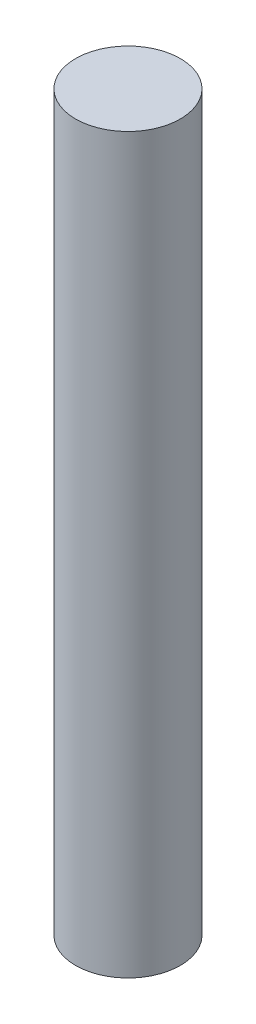
ISO-10303-21;
HEADER;
FILE_DESCRIPTION(('STEP AP214'),'2;1');
FILE_NAME('part.step','',(''),(''),'','','');
FILE_SCHEMA(('AUTOMOTIVE_DESIGN { 1 0 10303 214 1 1 1 1 }'));
ENDSEC;
DATA;
#1=APPLICATION_CONTEXT('core data for automotive mechanical design processes');
#2=APPLICATION_PROTOCOL_DEFINITION('international standard','automotive_design',2000,#1);
#3=PRODUCT_CONTEXT('',#1,'mechanical');
#4=PRODUCT('Part','Part','',(#3));
#5=PRODUCT_RELATED_PRODUCT_CATEGORY('part','',(#4));
#6=PRODUCT_DEFINITION_FORMATION('','',#4);
#7=PRODUCT_DEFINITION_CONTEXT('part definition',#1,'design');
#8=PRODUCT_DEFINITION('design','',#6,#7);
#9=PRODUCT_DEFINITION_SHAPE('','',#8);
#10=(LENGTH_UNIT() NAMED_UNIT(*) SI_UNIT(.MILLI.,.METRE.));
#11=(NAMED_UNIT(*) PLANE_ANGLE_UNIT() SI_UNIT($,.RADIAN.));
#12=(NAMED_UNIT(*) SI_UNIT($,.STERADIAN.) SOLID_ANGLE_UNIT());
#13=UNCERTAINTY_MEASURE_WITH_UNIT(LENGTH_MEASURE(1.E-05),#10,'distance_accuracy_value','');
#14=(GEOMETRIC_REPRESENTATION_CONTEXT(3) GLOBAL_UNCERTAINTY_ASSIGNED_CONTEXT((#13)) GLOBAL_UNIT_ASSIGNED_CONTEXT((#10,
#11,#12)) REPRESENTATION_CONTEXT('',''));
#15=CARTESIAN_POINT('',(0.,0.,0.));
#16=DIRECTION('',(0.,0.,1.));
#17=DIRECTION('',(1.,0.,0.));
#18=AXIS2_PLACEMENT_3D('',#15,#16,#17);
#19=CARTESIAN_POINT('',(0.,14.,0.));
#20=DIRECTION('',(0.,-1.,0.));
#21=DIRECTION('',(0.,0.,-1.));
#22=AXIS2_PLACEMENT_3D('',#19,#20,#21);
#23=CYLINDRICAL_SURFACE('',#22,1.);
#24=CARTESIAN_POINT('',(0.,14.,0.));
#25=DIRECTION('',(0.,1.,0.));
#26=DIRECTION('',(0.,0.,1.));
#27=AXIS2_PLACEMENT_3D('',#24,#25,#26);
#28=CIRCLE('',#27,1.);
#29=CARTESIAN_POINT('',(0.,14.,1.));
#30=VERTEX_POINT('',#29);
#31=EDGE_CURVE('E10',#30,#30,#28,.T.);
#32=ORIENTED_EDGE('',*,*,#31,.F.);
#33=EDGE_LOOP('',(#32));
#34=FACE_BOUND('',#33,.T.);
#35=CARTESIAN_POINT('',(0.,0.,0.));
#36=DIRECTION('',(0.,1.,0.));
#37=DIRECTION('',(0.,0.,1.));
#38=AXIS2_PLACEMENT_3D('',#35,#36,#37);
#39=CIRCLE('',#38,1.);
#40=CARTESIAN_POINT('',(0.,0.,1.));
#41=VERTEX_POINT('',#40);
#42=EDGE_CURVE('E32',#41,#41,#39,.T.);
#43=ORIENTED_EDGE('',*,*,#42,.T.);
#44=EDGE_LOOP('',(#43));
#45=FACE_BOUND('',#44,.T.);
#46=ADVANCED_FACE('F29',(#34,#45),#23,.T.);
#47=CARTESIAN_POINT('',(0.,14.,0.));
#48=DIRECTION('',(0.,1.,0.));
#49=DIRECTION('',(0.,0.,1.));
#50=AXIS2_PLACEMENT_3D('',#47,#48,#49);
#51=PLANE('',#50);
#52=ORIENTED_EDGE('',*,*,#31,.T.);
#53=EDGE_LOOP('',(#52));
#54=FACE_BOUND('',#53,.T.);
#55=ADVANCED_FACE('F44',(#54),#51,.T.);
#56=CARTESIAN_POINT('',(0.,0.,0.));
#57=DIRECTION('',(0.,1.,0.));
#58=DIRECTION('',(0.,0.,1.));
#59=AXIS2_PLACEMENT_3D('',#56,#57,#58);
#60=PLANE('',#59);
#61=ORIENTED_EDGE('',*,*,#42,.F.);
#62=EDGE_LOOP('',(#61));
#63=FACE_BOUND('',#62,.T.);
#64=ADVANCED_FACE('F42',(#63),#60,.F.);
#65=CLOSED_SHELL('',(#46,#55,#64));
#66=MANIFOLD_SOLID_BREP('B2',#65);
#67=ADVANCED_BREP_SHAPE_REPRESENTATION('',(#18,#66),#14);
#68=SHAPE_DEFINITION_REPRESENTATION(#9,#67);
ENDSEC;
END-ISO-10303-21;
